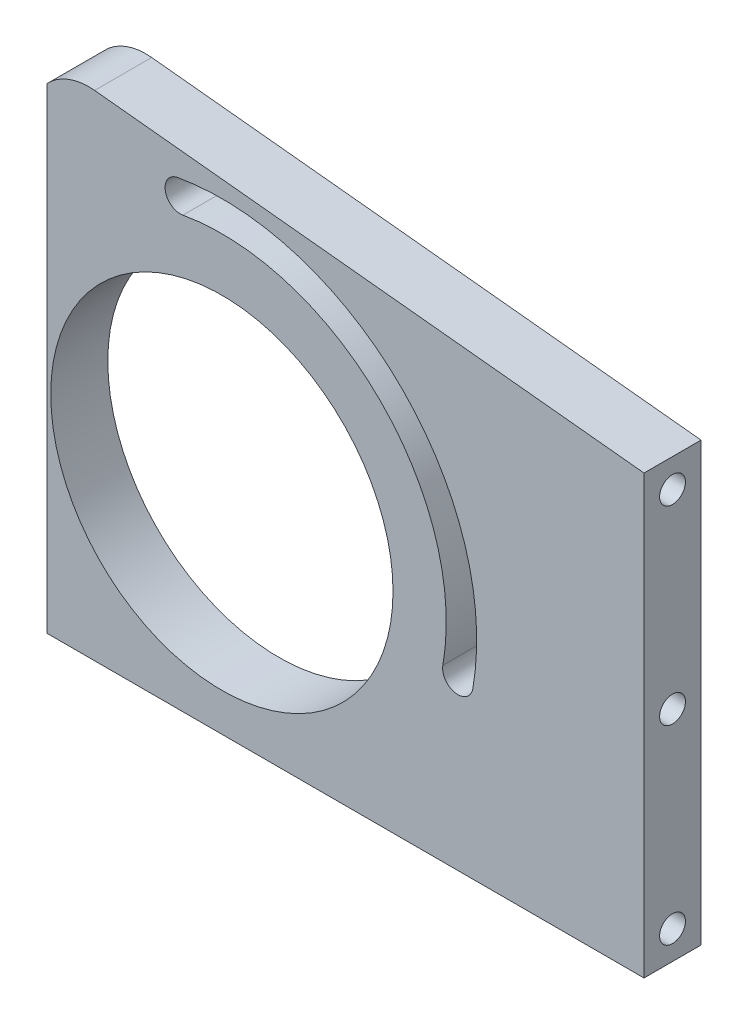
ISO-10303-21;
HEADER;
FILE_DESCRIPTION(('STEP AP214'),'2;1');
FILE_NAME('part.step','',(''),(''),'','','');
FILE_SCHEMA(('AUTOMOTIVE_DESIGN { 1 0 10303 214 1 1 1 1 }'));
ENDSEC;
DATA;
#1=APPLICATION_CONTEXT('core data for automotive mechanical design processes');
#2=APPLICATION_PROTOCOL_DEFINITION('international standard','automotive_design',2000,#1);
#3=PRODUCT_CONTEXT('',#1,'mechanical');
#4=PRODUCT('Part','Part','',(#3));
#5=PRODUCT_RELATED_PRODUCT_CATEGORY('part','',(#4));
#6=PRODUCT_DEFINITION_FORMATION('','',#4);
#7=PRODUCT_DEFINITION_CONTEXT('part definition',#1,'design');
#8=PRODUCT_DEFINITION('design','',#6,#7);
#9=PRODUCT_DEFINITION_SHAPE('','',#8);
#10=(LENGTH_UNIT() NAMED_UNIT(*) SI_UNIT(.MILLI.,.METRE.));
#11=(NAMED_UNIT(*) PLANE_ANGLE_UNIT() SI_UNIT($,.RADIAN.));
#12=(NAMED_UNIT(*) SI_UNIT($,.STERADIAN.) SOLID_ANGLE_UNIT());
#13=UNCERTAINTY_MEASURE_WITH_UNIT(LENGTH_MEASURE(1.E-05),#10,'distance_accuracy_value','');
#14=(GEOMETRIC_REPRESENTATION_CONTEXT(3) GLOBAL_UNCERTAINTY_ASSIGNED_CONTEXT((#13)) GLOBAL_UNIT_ASSIGNED_CONTEXT((#10,
#11,#12)) REPRESENTATION_CONTEXT('',''));
#15=CARTESIAN_POINT('',(0.,0.,0.));
#16=DIRECTION('',(0.,0.,1.));
#17=DIRECTION('',(1.,0.,0.));
#18=AXIS2_PLACEMENT_3D('',#15,#16,#17);
#19=CARTESIAN_POINT('',(-35.,59.9738962094959,7.5));
#20=DIRECTION('',(0.,0.,-1.));
#21=DIRECTION('',(-1.,0.,0.));
#22=AXIS2_PLACEMENT_3D('',#19,#20,#21);
#23=PLANE('',#22);
#24=CARTESIAN_POINT('',(0.,0.,7.5));
#25=DIRECTION('',(0.,0.,1.));
#26=DIRECTION('',(1.,0.,0.));
#27=AXIS2_PLACEMENT_3D('',#24,#25,#26);
#28=CIRCLE('',#27,45.);
#29=CARTESIAN_POINT('',(45.,0.,7.5));
#30=VERTEX_POINT('',#29);
#31=EDGE_CURVE('E157',#30,#30,#28,.T.);
#32=ORIENTED_EDGE('',*,*,#31,.F.);
#33=EDGE_LOOP('',(#32));
#34=FACE_BOUND('',#33,.T.);
#35=CARTESIAN_POINT('',(-35.,59.9738962094959,7.5));
#36=DIRECTION('',(0.,0.,1.));
#37=DIRECTION('',(-1.,0.,0.));
#38=AXIS2_PLACEMENT_3D('',#35,#36,#37);
#39=CIRCLE('',#38,15.);
#40=CARTESIAN_POINT('',(-33.461571863233,74.8947956082588,7.5));
#41=VERTEX_POINT('',#40);
#42=CARTESIAN_POINT('',(-46.,70.1719352366814,7.5));
#43=VERTEX_POINT('',#42);
#44=EDGE_CURVE('E165',#41,#43,#39,.T.);
#45=ORIENTED_EDGE('',*,*,#44,.T.);
#46=DIRECTION('',(0.,-1.,0.));
#47=VECTOR('',#46,1.);
#48=CARTESIAN_POINT('',(-46.,112.9,7.5));
#49=LINE('',#48,#47);
#50=CARTESIAN_POINT('',(-46.,-55.,7.5));
#51=VERTEX_POINT('',#50);
#52=EDGE_CURVE('E192',#43,#51,#49,.T.);
#53=ORIENTED_EDGE('',*,*,#52,.T.);
#54=DIRECTION('',(1.,0.,0.));
#55=VECTOR('',#54,1.);
#56=CARTESIAN_POINT('',(111.,-55.,7.5));
#57=LINE('',#56,#55);
#58=CARTESIAN_POINT('',(111.,-55.,7.5));
#59=VERTEX_POINT('',#58);
#60=EDGE_CURVE('E171',#51,#59,#57,.T.);
#61=ORIENTED_EDGE('',*,*,#60,.T.);
#62=DIRECTION('',(0.,1.,0.));
#63=VECTOR('',#62,1.);
#64=CARTESIAN_POINT('',(111.,60.,7.5));
#65=LINE('',#64,#63);
#66=CARTESIAN_POINT('',(111.,60.,7.5));
#67=VERTEX_POINT('',#66);
#68=EDGE_CURVE('E268',#59,#67,#65,.T.);
#69=ORIENTED_EDGE('',*,*,#68,.T.);
#70=DIRECTION('',(-0.994726626584196,0.102561875784457,0.));
#71=VECTOR('',#70,1.);
#72=CARTESIAN_POINT('',(-33.461571863233,74.8947956082588,7.5));
#73=LINE('',#72,#71);
#74=EDGE_CURVE('E269',#67,#41,#73,.T.);
#75=ORIENTED_EDGE('',*,*,#74,.T.);
#76=EDGE_LOOP('',(#45,#53,#61,#69,#75));
#77=FACE_BOUND('',#76,.T.);
#78=CARTESIAN_POINT('',(62.0428884397691,-10.9398351930167,7.5));
#79=DIRECTION('',(0.,0.,1.));
#80=DIRECTION('',(1.,0.,0.));
#81=AXIS2_PLACEMENT_3D('',#78,#79,#80);
#82=CIRCLE('',#81,4.);
#83=CARTESIAN_POINT('',(58.1036574277203,-10.2452424823489,7.5));
#84=VERTEX_POINT('',#83);
#85=CARTESIAN_POINT('',(65.9821194518179,-11.6344279036844,7.5));
#86=VERTEX_POINT('',#85);
#87=EDGE_CURVE('E235',#84,#86,#82,.T.);
#88=ORIENTED_EDGE('',*,*,#87,.F.);
#89=CARTESIAN_POINT('',(0.,0.,7.5));
#90=DIRECTION('',(0.,0.,-1.));
#91=DIRECTION('',(1.,0.,0.));
#92=AXIS2_PLACEMENT_3D('',#89,#90,#91);
#93=CIRCLE('',#92,59.);
#94=CARTESIAN_POINT('',(-10.245242482349,58.1036574277203,7.5));
#95=VERTEX_POINT('',#94);
#96=EDGE_CURVE('E243',#95,#84,#93,.T.);
#97=ORIENTED_EDGE('',*,*,#96,.F.);
#98=CARTESIAN_POINT('',(-10.9398351930167,62.0428884397691,7.5));
#99=DIRECTION('',(0.,0.,1.));
#100=DIRECTION('',(1.,0.,0.));
#101=AXIS2_PLACEMENT_3D('',#98,#99,#100);
#102=CIRCLE('',#101,4.);
#103=CARTESIAN_POINT('',(-11.6344279036844,65.9821194518179,7.5));
#104=VERTEX_POINT('',#103);
#105=EDGE_CURVE('E240',#104,#95,#102,.T.);
#106=ORIENTED_EDGE('',*,*,#105,.F.);
#107=CARTESIAN_POINT('',(0.,0.,7.5));
#108=DIRECTION('',(0.,0.,1.));
#109=DIRECTION('',(1.,0.,0.));
#110=AXIS2_PLACEMENT_3D('',#107,#108,#109);
#111=CIRCLE('',#110,67.);
#112=EDGE_CURVE('E237',#86,#104,#111,.T.);
#113=ORIENTED_EDGE('',*,*,#112,.F.);
#114=EDGE_LOOP('',(#88,#97,#106,#113));
#115=FACE_BOUND('',#114,.T.);
#116=ADVANCED_FACE('F36',(#34,#77,#115),#23,.F.);
#117=CARTESIAN_POINT('',(-35.,59.9738962094959,-7.5));
#118=DIRECTION('',(0.,0.,-1.));
#119=DIRECTION('',(-1.,0.,0.));
#120=AXIS2_PLACEMENT_3D('',#117,#118,#119);
#121=PLANE('',#120);
#122=DIRECTION('',(0.,-1.,0.));
#123=VECTOR('',#122,1.);
#124=CARTESIAN_POINT('',(-46.,112.9,-7.5));
#125=LINE('',#124,#123);
#126=CARTESIAN_POINT('',(-46.,70.1719352366814,-7.5));
#127=VERTEX_POINT('',#126);
#128=CARTESIAN_POINT('',(-46.,-55.,-7.5));
#129=VERTEX_POINT('',#128);
#130=EDGE_CURVE('E134',#127,#129,#125,.T.);
#131=ORIENTED_EDGE('',*,*,#130,.F.);
#132=CARTESIAN_POINT('',(-35.,59.9738962094959,-7.5));
#133=DIRECTION('',(0.,0.,1.));
#134=DIRECTION('',(-1.,0.,0.));
#135=AXIS2_PLACEMENT_3D('',#132,#133,#134);
#136=CIRCLE('',#135,15.);
#137=CARTESIAN_POINT('',(-33.461571863233,74.8947956082588,-7.5));
#138=VERTEX_POINT('',#137);
#139=EDGE_CURVE('E169',#138,#127,#136,.T.);
#140=ORIENTED_EDGE('',*,*,#139,.F.);
#141=DIRECTION('',(-0.994726626584196,0.102561875784457,0.));
#142=VECTOR('',#141,1.);
#143=CARTESIAN_POINT('',(-33.461571863233,74.8947956082588,-7.5));
#144=LINE('',#143,#142);
#145=CARTESIAN_POINT('',(111.,60.,-7.5));
#146=VERTEX_POINT('',#145);
#147=EDGE_CURVE('E159',#146,#138,#144,.T.);
#148=ORIENTED_EDGE('',*,*,#147,.F.);
#149=DIRECTION('',(0.,1.,0.));
#150=VECTOR('',#149,1.);
#151=CARTESIAN_POINT('',(111.,60.,-7.5));
#152=LINE('',#151,#150);
#153=CARTESIAN_POINT('',(111.,-55.,-7.5));
#154=VERTEX_POINT('',#153);
#155=EDGE_CURVE('E155',#154,#146,#152,.T.);
#156=ORIENTED_EDGE('',*,*,#155,.F.);
#157=DIRECTION('',(1.,0.,0.));
#158=VECTOR('',#157,1.);
#159=CARTESIAN_POINT('',(111.,-55.,-7.5));
#160=LINE('',#159,#158);
#161=EDGE_CURVE('E146',#129,#154,#160,.T.);
#162=ORIENTED_EDGE('',*,*,#161,.F.);
#163=EDGE_LOOP('',(#131,#140,#148,#156,#162));
#164=FACE_BOUND('',#163,.T.);
#165=CARTESIAN_POINT('',(0.,0.,-7.5));
#166=DIRECTION('',(0.,0.,1.));
#167=DIRECTION('',(1.,0.,0.));
#168=AXIS2_PLACEMENT_3D('',#165,#166,#167);
#169=CIRCLE('',#168,45.);
#170=CARTESIAN_POINT('',(45.,0.,-7.5));
#171=VERTEX_POINT('',#170);
#172=EDGE_CURVE('E162',#171,#171,#169,.T.);
#173=ORIENTED_EDGE('',*,*,#172,.T.);
#174=EDGE_LOOP('',(#173));
#175=FACE_BOUND('',#174,.T.);
#176=CARTESIAN_POINT('',(0.,0.,-7.5));
#177=DIRECTION('',(0.,0.,-1.));
#178=DIRECTION('',(1.,0.,0.));
#179=AXIS2_PLACEMENT_3D('',#176,#177,#178);
#180=CIRCLE('',#179,59.);
#181=CARTESIAN_POINT('',(-10.245242482349,58.1036574277203,-7.5));
#182=VERTEX_POINT('',#181);
#183=CARTESIAN_POINT('',(58.1036574277203,-10.2452424823489,-7.5));
#184=VERTEX_POINT('',#183);
#185=EDGE_CURVE('E238',#182,#184,#180,.T.);
#186=ORIENTED_EDGE('',*,*,#185,.T.);
#187=CARTESIAN_POINT('',(62.0428884397691,-10.9398351930167,-7.5));
#188=DIRECTION('',(0.,0.,1.));
#189=DIRECTION('',(1.,0.,0.));
#190=AXIS2_PLACEMENT_3D('',#187,#188,#189);
#191=CIRCLE('',#190,4.);
#192=CARTESIAN_POINT('',(65.9821194518179,-11.6344279036844,-7.5));
#193=VERTEX_POINT('',#192);
#194=EDGE_CURVE('E234',#184,#193,#191,.T.);
#195=ORIENTED_EDGE('',*,*,#194,.T.);
#196=CARTESIAN_POINT('',(0.,0.,-7.5));
#197=DIRECTION('',(0.,0.,1.));
#198=DIRECTION('',(1.,0.,0.));
#199=AXIS2_PLACEMENT_3D('',#196,#197,#198);
#200=CIRCLE('',#199,67.);
#201=CARTESIAN_POINT('',(-11.6344279036844,65.9821194518179,-7.5));
#202=VERTEX_POINT('',#201);
#203=EDGE_CURVE('E248',#193,#202,#200,.T.);
#204=ORIENTED_EDGE('',*,*,#203,.T.);
#205=CARTESIAN_POINT('',(-10.9398351930167,62.0428884397691,-7.5));
#206=DIRECTION('',(0.,0.,1.));
#207=DIRECTION('',(1.,0.,0.));
#208=AXIS2_PLACEMENT_3D('',#205,#206,#207);
#209=CIRCLE('',#208,4.);
#210=EDGE_CURVE('E251',#202,#182,#209,.T.);
#211=ORIENTED_EDGE('',*,*,#210,.T.);
#212=EDGE_LOOP('',(#186,#195,#204,#211));
#213=FACE_BOUND('',#212,.T.);
#214=ADVANCED_FACE('F152',(#164,#175,#213),#121,.T.);
#215=CARTESIAN_POINT('',(111.,-55.,7.5));
#216=DIRECTION('',(0.,1.,0.));
#217=DIRECTION('',(-1.,0.,0.));
#218=AXIS2_PLACEMENT_3D('',#215,#216,#217);
#219=PLANE('',#218);
#220=CARTESIAN_POINT('',(-42.5,-55.,0.));
#221=DIRECTION('',(0.,-1.,0.));
#222=DIRECTION('',(0.,0.,-1.));
#223=AXIS2_PLACEMENT_3D('',#220,#221,#222);
#224=CIRCLE('',#223,3.39999999999999);
#225=CARTESIAN_POINT('',(-42.5,-55.,-3.39999999999999));
#226=VERTEX_POINT('',#225);
#227=EDGE_CURVE('E198',#226,#226,#224,.T.);
#228=ORIENTED_EDGE('',*,*,#227,.F.);
#229=EDGE_LOOP('',(#228));
#230=FACE_BOUND('',#229,.T.);
#231=CARTESIAN_POINT('',(16.3,-55.,0.));
#232=DIRECTION('',(0.,-1.,0.));
#233=DIRECTION('',(0.,0.,-1.));
#234=AXIS2_PLACEMENT_3D('',#231,#232,#233);
#235=CIRCLE('',#234,3.39999999999999);
#236=CARTESIAN_POINT('',(16.3,-55.,-3.39999999999999));
#237=VERTEX_POINT('',#236);
#238=EDGE_CURVE('E204',#237,#237,#235,.T.);
#239=ORIENTED_EDGE('',*,*,#238,.F.);
#240=EDGE_LOOP('',(#239));
#241=FACE_BOUND('',#240,.T.);
#242=CARTESIAN_POINT('',(75.1,-55.,0.));
#243=DIRECTION('',(0.,-1.,0.));
#244=DIRECTION('',(0.,0.,-1.));
#245=AXIS2_PLACEMENT_3D('',#242,#243,#244);
#246=CIRCLE('',#245,3.39999999999999);
#247=CARTESIAN_POINT('',(75.1,-55.,-3.39999999999999));
#248=VERTEX_POINT('',#247);
#249=EDGE_CURVE('E210',#248,#248,#246,.T.);
#250=ORIENTED_EDGE('',*,*,#249,.F.);
#251=EDGE_LOOP('',(#250));
#252=FACE_BOUND('',#251,.T.);
#253=DIRECTION('',(0.,0.,-1.));
#254=VECTOR('',#253,1.);
#255=CARTESIAN_POINT('',(-50.,-55.,7.5));
#256=LINE('',#255,#254);
#257=CARTESIAN_POINT('',(-50.,-55.,3.5));
#258=VERTEX_POINT('',#257);
#259=CARTESIAN_POINT('',(-50.,-55.,-3.5));
#260=VERTEX_POINT('',#259);
#261=EDGE_CURVE('E150',#258,#260,#256,.T.);
#262=ORIENTED_EDGE('',*,*,#261,.T.);
#263=DIRECTION('',(-0.707106781186548,0.,0.707106781186547));
#264=VECTOR('',#263,1.);
#265=CARTESIAN_POINT('',(-50.,-55.,-3.5));
#266=LINE('',#265,#264);
#267=EDGE_CURVE('E51',#129,#260,#266,.T.);
#268=ORIENTED_EDGE('',*,*,#267,.F.);
#269=ORIENTED_EDGE('',*,*,#161,.T.);
#270=DIRECTION('',(0.,0.,-1.));
#271=VECTOR('',#270,1.);
#272=CARTESIAN_POINT('',(111.,-55.,7.5));
#273=LINE('',#272,#271);
#274=EDGE_CURVE('E182',#59,#154,#273,.T.);
#275=ORIENTED_EDGE('',*,*,#274,.F.);
#276=ORIENTED_EDGE('',*,*,#60,.F.);
#277=DIRECTION('',(0.707106781186547,0.,0.707106781186548));
#278=VECTOR('',#277,1.);
#279=CARTESIAN_POINT('',(-50.,-55.,3.5));
#280=LINE('',#279,#278);
#281=EDGE_CURVE('E190',#258,#51,#280,.T.);
#282=ORIENTED_EDGE('',*,*,#281,.F.);
#283=EDGE_LOOP('',(#262,#268,#269,#275,#276,#282));
#284=FACE_BOUND('',#283,.T.);
#285=ADVANCED_FACE('F38',(#230,#241,#252,#284),#219,.F.);
#286=CARTESIAN_POINT('',(111.,60.,7.5));
#287=DIRECTION('',(-1.,0.,0.));
#288=DIRECTION('',(0.,0.,1.));
#289=AXIS2_PLACEMENT_3D('',#286,#287,#288);
#290=PLANE('',#289);
#291=CARTESIAN_POINT('',(111.,52.5,0.));
#292=DIRECTION('',(1.,0.,0.));
#293=DIRECTION('',(0.,0.,-1.));
#294=AXIS2_PLACEMENT_3D('',#291,#292,#293);
#295=CIRCLE('',#294,3.4);
#296=CARTESIAN_POINT('',(111.,52.5,-3.4));
#297=VERTEX_POINT('',#296);
#298=EDGE_CURVE('E216',#297,#297,#295,.T.);
#299=ORIENTED_EDGE('',*,*,#298,.F.);
#300=EDGE_LOOP('',(#299));
#301=FACE_BOUND('',#300,.T.);
#302=CARTESIAN_POINT('',(111.,2.50000000000002,0.));
#303=DIRECTION('',(1.,0.,0.));
#304=DIRECTION('',(0.,0.,-1.));
#305=AXIS2_PLACEMENT_3D('',#302,#303,#304);
#306=CIRCLE('',#305,3.4);
#307=CARTESIAN_POINT('',(111.,2.50000000000002,-3.4));
#308=VERTEX_POINT('',#307);
#309=EDGE_CURVE('E222',#308,#308,#306,.T.);
#310=ORIENTED_EDGE('',*,*,#309,.F.);
#311=EDGE_LOOP('',(#310));
#312=FACE_BOUND('',#311,.T.);
#313=CARTESIAN_POINT('',(111.,-47.5,0.));
#314=DIRECTION('',(1.,0.,0.));
#315=DIRECTION('',(0.,0.,-1.));
#316=AXIS2_PLACEMENT_3D('',#313,#314,#315);
#317=CIRCLE('',#316,3.4);
#318=CARTESIAN_POINT('',(111.,-47.5,-3.4));
#319=VERTEX_POINT('',#318);
#320=EDGE_CURVE('E228',#319,#319,#317,.T.);
#321=ORIENTED_EDGE('',*,*,#320,.F.);
#322=EDGE_LOOP('',(#321));
#323=FACE_BOUND('',#322,.T.);
#324=ORIENTED_EDGE('',*,*,#155,.T.);
#325=DIRECTION('',(0.,0.,-1.));
#326=VECTOR('',#325,1.);
#327=CARTESIAN_POINT('',(111.,60.,7.5));
#328=LINE('',#327,#326);
#329=EDGE_CURVE('E179',#67,#146,#328,.T.);
#330=ORIENTED_EDGE('',*,*,#329,.F.);
#331=ORIENTED_EDGE('',*,*,#68,.F.);
#332=ORIENTED_EDGE('',*,*,#274,.T.);
#333=EDGE_LOOP('',(#324,#330,#331,#332));
#334=FACE_BOUND('',#333,.T.);
#335=ADVANCED_FACE('F280',(#301,#312,#323,#334),#290,.F.);
#336=CARTESIAN_POINT('',(-33.461571863233,74.8947956082588,7.5));
#337=DIRECTION('',(-0.102561875784457,-0.994726626584196,0.));
#338=DIRECTION('',(0.994726626584196,-0.102561875784457,0.));
#339=AXIS2_PLACEMENT_3D('',#336,#337,#338);
#340=PLANE('',#339);
#341=ORIENTED_EDGE('',*,*,#147,.T.);
#342=DIRECTION('',(0.,0.,-1.));
#343=VECTOR('',#342,1.);
#344=CARTESIAN_POINT('',(-33.461571863233,74.8947956082588,7.5));
#345=LINE('',#344,#343);
#346=EDGE_CURVE('E176',#41,#138,#345,.T.);
#347=ORIENTED_EDGE('',*,*,#346,.F.);
#348=ORIENTED_EDGE('',*,*,#74,.F.);
#349=ORIENTED_EDGE('',*,*,#329,.T.);
#350=EDGE_LOOP('',(#341,#347,#348,#349));
#351=FACE_BOUND('',#350,.T.);
#352=ADVANCED_FACE('F276',(#351),#340,.F.);
#353=CARTESIAN_POINT('',(-35.,59.9738962094959,7.5));
#354=DIRECTION('',(0.,0.,-1.));
#355=DIRECTION('',(-1.,0.,0.));
#356=AXIS2_PLACEMENT_3D('',#353,#354,#355);
#357=CYLINDRICAL_SURFACE('',#356,15.);
#358=ORIENTED_EDGE('',*,*,#139,.T.);
#359=CARTESIAN_POINT('',(-35.,59.9738962094959,-18.5));
#360=DIRECTION('',(0.707106781186547,0.,0.707106781186548));
#361=DIRECTION('',(0.707106781186548,0.,-0.707106781186547));
#362=AXIS2_PLACEMENT_3D('',#359,#360,#361);
#363=ELLIPSE('',#362,21.2132034355964,15.);
#364=CARTESIAN_POINT('',(-50.,59.9738962094958,-3.5));
#365=VERTEX_POINT('',#364);
#366=EDGE_CURVE('E137',#127,#365,#363,.T.);
#367=ORIENTED_EDGE('',*,*,#366,.T.);
#368=DIRECTION('',(0.,0.,-1.));
#369=VECTOR('',#368,1.);
#370=CARTESIAN_POINT('',(-50.,59.9738962094958,7.5));
#371=LINE('',#370,#369);
#372=CARTESIAN_POINT('',(-50.,59.9738962094958,3.50000000000001));
#373=VERTEX_POINT('',#372);
#374=EDGE_CURVE('E173',#373,#365,#371,.T.);
#375=ORIENTED_EDGE('',*,*,#374,.F.);
#376=CARTESIAN_POINT('',(-35.,59.9738962094959,18.5));
#377=DIRECTION('',(0.707106781186548,0.,-0.707106781186547));
#378=DIRECTION('',(-0.707106781186547,0.,-0.707106781186548));
#379=AXIS2_PLACEMENT_3D('',#376,#377,#378);
#380=ELLIPSE('',#379,21.2132034355964,15.);
#381=EDGE_CURVE('E58',#373,#43,#380,.T.);
#382=ORIENTED_EDGE('',*,*,#381,.T.);
#383=ORIENTED_EDGE('',*,*,#44,.F.);
#384=ORIENTED_EDGE('',*,*,#346,.T.);
#385=EDGE_LOOP('',(#358,#367,#375,#382,#383,#384));
#386=FACE_BOUND('',#385,.T.);
#387=ADVANCED_FACE('F187',(#386),#357,.T.);
#388=CARTESIAN_POINT('',(-50.,-55.,7.5));
#389=DIRECTION('',(1.,0.,0.));
#390=DIRECTION('',(0.,0.,-1.));
#391=AXIS2_PLACEMENT_3D('',#388,#389,#390);
#392=PLANE('',#391);
#393=ORIENTED_EDGE('',*,*,#374,.T.);
#394=DIRECTION('',(0.,-1.,0.));
#395=VECTOR('',#394,1.);
#396=CARTESIAN_POINT('',(-50.,-55.,-3.5));
#397=LINE('',#396,#395);
#398=EDGE_CURVE('E11',#365,#260,#397,.T.);
#399=ORIENTED_EDGE('',*,*,#398,.T.);
#400=ORIENTED_EDGE('',*,*,#261,.F.);
#401=DIRECTION('',(0.,1.,0.));
#402=VECTOR('',#401,1.);
#403=CARTESIAN_POINT('',(-50.,-55.,3.5));
#404=LINE('',#403,#402);
#405=EDGE_CURVE('E44',#258,#373,#404,.T.);
#406=ORIENTED_EDGE('',*,*,#405,.T.);
#407=EDGE_LOOP('',(#393,#399,#400,#406));
#408=FACE_BOUND('',#407,.T.);
#409=ADVANCED_FACE('F185',(#408),#392,.F.);
#410=CARTESIAN_POINT('',(0.,0.,7.5));
#411=DIRECTION('',(0.,0.,-1.));
#412=DIRECTION('',(-1.,0.,0.));
#413=AXIS2_PLACEMENT_3D('',#410,#411,#412);
#414=CYLINDRICAL_SURFACE('',#413,45.);
#415=ORIENTED_EDGE('',*,*,#31,.T.);
#416=EDGE_LOOP('',(#415));
#417=FACE_BOUND('',#416,.T.);
#418=ORIENTED_EDGE('',*,*,#172,.F.);
#419=EDGE_LOOP('',(#418));
#420=FACE_BOUND('',#419,.T.);
#421=ADVANCED_FACE('F302',(#417,#420),#414,.F.);
#422=CARTESIAN_POINT('',(62.0428884397691,-10.9398351930167,7.5));
#423=DIRECTION('',(0.,0.,-1.));
#424=DIRECTION('',(-1.,0.,0.));
#425=AXIS2_PLACEMENT_3D('',#422,#423,#424);
#426=CYLINDRICAL_SURFACE('',#425,4.);
#427=ORIENTED_EDGE('',*,*,#194,.F.);
#428=DIRECTION('',(0.,0.,-1.));
#429=VECTOR('',#428,1.);
#430=CARTESIAN_POINT('',(58.1036574277203,-10.2452424823489,7.5));
#431=LINE('',#430,#429);
#432=EDGE_CURVE('E245',#84,#184,#431,.T.);
#433=ORIENTED_EDGE('',*,*,#432,.F.);
#434=ORIENTED_EDGE('',*,*,#87,.T.);
#435=DIRECTION('',(0.,0.,-1.));
#436=VECTOR('',#435,1.);
#437=CARTESIAN_POINT('',(65.9821194518179,-11.6344279036844,7.5));
#438=LINE('',#437,#436);
#439=EDGE_CURVE('E262',#86,#193,#438,.T.);
#440=ORIENTED_EDGE('',*,*,#439,.T.);
#441=EDGE_LOOP('',(#427,#433,#434,#440));
#442=FACE_BOUND('',#441,.T.);
#443=ADVANCED_FACE('F350',(#442),#426,.F.);
#444=CARTESIAN_POINT('',(0.,0.,7.5));
#445=DIRECTION('',(0.,0.,-1.));
#446=DIRECTION('',(-1.,0.,0.));
#447=AXIS2_PLACEMENT_3D('',#444,#445,#446);
#448=CYLINDRICAL_SURFACE('',#447,67.);
#449=ORIENTED_EDGE('',*,*,#203,.F.);
#450=ORIENTED_EDGE('',*,*,#439,.F.);
#451=ORIENTED_EDGE('',*,*,#112,.T.);
#452=DIRECTION('',(0.,0.,-1.));
#453=VECTOR('',#452,1.);
#454=CARTESIAN_POINT('',(-11.6344279036844,65.9821194518179,7.5));
#455=LINE('',#454,#453);
#456=EDGE_CURVE('E260',#104,#202,#455,.T.);
#457=ORIENTED_EDGE('',*,*,#456,.T.);
#458=EDGE_LOOP('',(#449,#450,#451,#457));
#459=FACE_BOUND('',#458,.T.);
#460=ADVANCED_FACE('F347',(#459),#448,.F.);
#461=CARTESIAN_POINT('',(-10.9398351930167,62.0428884397691,7.5));
#462=DIRECTION('',(0.,0.,-1.));
#463=DIRECTION('',(-1.,0.,0.));
#464=AXIS2_PLACEMENT_3D('',#461,#462,#463);
#465=CYLINDRICAL_SURFACE('',#464,4.);
#466=ORIENTED_EDGE('',*,*,#210,.F.);
#467=ORIENTED_EDGE('',*,*,#456,.F.);
#468=ORIENTED_EDGE('',*,*,#105,.T.);
#469=DIRECTION('',(0.,0.,-1.));
#470=VECTOR('',#469,1.);
#471=CARTESIAN_POINT('',(-10.245242482349,58.1036574277203,7.5));
#472=LINE('',#471,#470);
#473=EDGE_CURVE('E258',#95,#182,#472,.T.);
#474=ORIENTED_EDGE('',*,*,#473,.T.);
#475=EDGE_LOOP('',(#466,#467,#468,#474));
#476=FACE_BOUND('',#475,.T.);
#477=ADVANCED_FACE('F343',(#476),#465,.F.);
#478=CARTESIAN_POINT('',(0.,0.,7.5));
#479=DIRECTION('',(0.,0.,-1.));
#480=DIRECTION('',(-1.,0.,0.));
#481=AXIS2_PLACEMENT_3D('',#478,#479,#480);
#482=CYLINDRICAL_SURFACE('',#481,59.);
#483=ORIENTED_EDGE('',*,*,#185,.F.);
#484=ORIENTED_EDGE('',*,*,#473,.F.);
#485=ORIENTED_EDGE('',*,*,#96,.T.);
#486=ORIENTED_EDGE('',*,*,#432,.T.);
#487=EDGE_LOOP('',(#483,#484,#485,#486));
#488=FACE_BOUND('',#487,.T.);
#489=ADVANCED_FACE('F335',(#488),#482,.T.);
#490=CARTESIAN_POINT('',(91.,-47.5,0.));
#491=DIRECTION('',(1.,0.,0.));
#492=DIRECTION('',(0.,0.,-1.));
#493=AXIS2_PLACEMENT_3D('',#490,#491,#492);
#494=CONICAL_SURFACE('',#493,3.39999999999999,1.02974425867665);
#495=CARTESIAN_POINT('',(88.9570738953063,-47.5,0.));
#496=VERTEX_POINT('',#495);
#497=VERTEX_LOOP('',#496);
#498=FACE_BOUND('',#497,.T.);
#499=CARTESIAN_POINT('',(91.,-47.5,0.));
#500=DIRECTION('',(1.,0.,0.));
#501=DIRECTION('',(0.,0.,-1.));
#502=AXIS2_PLACEMENT_3D('',#499,#500,#501);
#503=CIRCLE('',#502,3.39999999999999);
#504=CARTESIAN_POINT('',(91.,-47.5,-3.39999999999999));
#505=VERTEX_POINT('',#504);
#506=EDGE_CURVE('E231',#505,#505,#503,.T.);
#507=ORIENTED_EDGE('',*,*,#506,.T.);
#508=EDGE_LOOP('',(#507));
#509=FACE_BOUND('',#508,.T.);
#510=ADVANCED_FACE('F325',(#498,#509),#494,.F.);
#511=CARTESIAN_POINT('',(111.,-47.5,0.));
#512=DIRECTION('',(1.,0.,0.));
#513=DIRECTION('',(0.,0.,-1.));
#514=AXIS2_PLACEMENT_3D('',#511,#512,#513);
#515=CYLINDRICAL_SURFACE('',#514,3.4);
#516=ORIENTED_EDGE('',*,*,#506,.F.);
#517=EDGE_LOOP('',(#516));
#518=FACE_BOUND('',#517,.T.);
#519=ORIENTED_EDGE('',*,*,#320,.T.);
#520=EDGE_LOOP('',(#519));
#521=FACE_BOUND('',#520,.T.);
#522=ADVANCED_FACE('F322',(#518,#521),#515,.F.);
#523=CARTESIAN_POINT('',(91.,2.50000000000002,0.));
#524=DIRECTION('',(1.,0.,0.));
#525=DIRECTION('',(0.,0.,-1.));
#526=AXIS2_PLACEMENT_3D('',#523,#524,#525);
#527=CONICAL_SURFACE('',#526,3.4,1.02974425867665);
#528=CARTESIAN_POINT('',(88.9570738953063,2.50000000000001,0.));
#529=VERTEX_POINT('',#528);
#530=VERTEX_LOOP('',#529);
#531=FACE_BOUND('',#530,.T.);
#532=CARTESIAN_POINT('',(91.,2.50000000000002,0.));
#533=DIRECTION('',(1.,0.,0.));
#534=DIRECTION('',(0.,0.,-1.));
#535=AXIS2_PLACEMENT_3D('',#532,#533,#534);
#536=CIRCLE('',#535,3.4);
#537=CARTESIAN_POINT('',(91.,2.50000000000002,-3.4));
#538=VERTEX_POINT('',#537);
#539=EDGE_CURVE('E225',#538,#538,#536,.T.);
#540=ORIENTED_EDGE('',*,*,#539,.T.);
#541=EDGE_LOOP('',(#540));
#542=FACE_BOUND('',#541,.T.);
#543=ADVANCED_FACE('F324',(#531,#542),#527,.F.);
#544=CARTESIAN_POINT('',(111.,2.50000000000002,0.));
#545=DIRECTION('',(1.,0.,0.));
#546=DIRECTION('',(0.,0.,-1.));
#547=AXIS2_PLACEMENT_3D('',#544,#545,#546);
#548=CYLINDRICAL_SURFACE('',#547,3.4);
#549=ORIENTED_EDGE('',*,*,#539,.F.);
#550=EDGE_LOOP('',(#549));
#551=FACE_BOUND('',#550,.T.);
#552=ORIENTED_EDGE('',*,*,#309,.T.);
#553=EDGE_LOOP('',(#552));
#554=FACE_BOUND('',#553,.T.);
#555=ADVANCED_FACE('F332',(#551,#554),#548,.F.);
#556=CARTESIAN_POINT('',(91.,52.5,0.));
#557=DIRECTION('',(1.,0.,0.));
#558=DIRECTION('',(0.,0.,-1.));
#559=AXIS2_PLACEMENT_3D('',#556,#557,#558);
#560=CONICAL_SURFACE('',#559,3.39999999999999,1.02974425867665);
#561=CARTESIAN_POINT('',(88.9570738953063,52.5,0.));
#562=VERTEX_POINT('',#561);
#563=VERTEX_LOOP('',#562);
#564=FACE_BOUND('',#563,.T.);
#565=CARTESIAN_POINT('',(91.,52.5,0.));
#566=DIRECTION('',(1.,0.,0.));
#567=DIRECTION('',(0.,0.,-1.));
#568=AXIS2_PLACEMENT_3D('',#565,#566,#567);
#569=CIRCLE('',#568,3.39999999999999);
#570=CARTESIAN_POINT('',(91.,52.5,-3.39999999999999));
#571=VERTEX_POINT('',#570);
#572=EDGE_CURVE('E219',#571,#571,#569,.T.);
#573=ORIENTED_EDGE('',*,*,#572,.T.);
#574=EDGE_LOOP('',(#573));
#575=FACE_BOUND('',#574,.T.);
#576=ADVANCED_FACE('F440',(#564,#575),#560,.F.);
#577=CARTESIAN_POINT('',(111.,52.5,0.));
#578=DIRECTION('',(1.,0.,0.));
#579=DIRECTION('',(0.,0.,-1.));
#580=AXIS2_PLACEMENT_3D('',#577,#578,#579);
#581=CYLINDRICAL_SURFACE('',#580,3.4);
#582=ORIENTED_EDGE('',*,*,#572,.F.);
#583=EDGE_LOOP('',(#582));
#584=FACE_BOUND('',#583,.T.);
#585=ORIENTED_EDGE('',*,*,#298,.T.);
#586=EDGE_LOOP('',(#585));
#587=FACE_BOUND('',#586,.T.);
#588=ADVANCED_FACE('F449',(#584,#587),#581,.F.);
#589=CARTESIAN_POINT('',(75.1,-45.,0.));
#590=DIRECTION('',(0.,-1.,0.));
#591=DIRECTION('',(0.,0.,-1.));
#592=AXIS2_PLACEMENT_3D('',#589,#590,#591);
#593=CONICAL_SURFACE('',#592,3.4,1.02974425867665);
#594=CARTESIAN_POINT('',(75.1,-42.9570738953063,0.));
#595=VERTEX_POINT('',#594);
#596=VERTEX_LOOP('',#595);
#597=FACE_BOUND('',#596,.T.);
#598=CARTESIAN_POINT('',(75.1,-45.,0.));
#599=DIRECTION('',(0.,-1.,0.));
#600=DIRECTION('',(0.,0.,-1.));
#601=AXIS2_PLACEMENT_3D('',#598,#599,#600);
#602=CIRCLE('',#601,3.4);
#603=CARTESIAN_POINT('',(75.1,-45.,-3.4));
#604=VERTEX_POINT('',#603);
#605=EDGE_CURVE('E213',#604,#604,#602,.T.);
#606=ORIENTED_EDGE('',*,*,#605,.T.);
#607=EDGE_LOOP('',(#606));
#608=FACE_BOUND('',#607,.T.);
#609=ADVANCED_FACE('F458',(#597,#608),#593,.F.);
#610=CARTESIAN_POINT('',(75.1,-55.,0.));
#611=DIRECTION('',(0.,-1.,0.));
#612=DIRECTION('',(0.,0.,-1.));
#613=AXIS2_PLACEMENT_3D('',#610,#611,#612);
#614=CYLINDRICAL_SURFACE('',#613,3.39999999999999);
#615=ORIENTED_EDGE('',*,*,#605,.F.);
#616=EDGE_LOOP('',(#615));
#617=FACE_BOUND('',#616,.T.);
#618=ORIENTED_EDGE('',*,*,#249,.T.);
#619=EDGE_LOOP('',(#618));
#620=FACE_BOUND('',#619,.T.);
#621=ADVANCED_FACE('F468',(#617,#620),#614,.F.);
#622=CARTESIAN_POINT('',(16.3,-45.,0.));
#623=DIRECTION('',(0.,-1.,0.));
#624=DIRECTION('',(0.,0.,-1.));
#625=AXIS2_PLACEMENT_3D('',#622,#623,#624);
#626=CONICAL_SURFACE('',#625,3.4,1.02974425867665);
#627=CARTESIAN_POINT('',(16.3,-42.9570738953063,0.));
#628=VERTEX_POINT('',#627);
#629=VERTEX_LOOP('',#628);
#630=FACE_BOUND('',#629,.T.);
#631=CARTESIAN_POINT('',(16.3,-45.,0.));
#632=DIRECTION('',(0.,-1.,0.));
#633=DIRECTION('',(0.,0.,-1.));
#634=AXIS2_PLACEMENT_3D('',#631,#632,#633);
#635=CIRCLE('',#634,3.4);
#636=CARTESIAN_POINT('',(16.3,-45.,-3.4));
#637=VERTEX_POINT('',#636);
#638=EDGE_CURVE('E207',#637,#637,#635,.T.);
#639=ORIENTED_EDGE('',*,*,#638,.T.);
#640=EDGE_LOOP('',(#639));
#641=FACE_BOUND('',#640,.T.);
#642=ADVANCED_FACE('F477',(#630,#641),#626,.F.);
#643=CARTESIAN_POINT('',(16.3,-55.,0.));
#644=DIRECTION('',(0.,-1.,0.));
#645=DIRECTION('',(0.,0.,-1.));
#646=AXIS2_PLACEMENT_3D('',#643,#644,#645);
#647=CYLINDRICAL_SURFACE('',#646,3.39999999999999);
#648=ORIENTED_EDGE('',*,*,#638,.F.);
#649=EDGE_LOOP('',(#648));
#650=FACE_BOUND('',#649,.T.);
#651=ORIENTED_EDGE('',*,*,#238,.T.);
#652=EDGE_LOOP('',(#651));
#653=FACE_BOUND('',#652,.T.);
#654=ADVANCED_FACE('F487',(#650,#653),#647,.F.);
#655=CARTESIAN_POINT('',(-42.5,-45.,0.));
#656=DIRECTION('',(0.,-1.,0.));
#657=DIRECTION('',(0.,0.,-1.));
#658=AXIS2_PLACEMENT_3D('',#655,#656,#657);
#659=CONICAL_SURFACE('',#658,3.39999999999999,1.02974425867665);
#660=CARTESIAN_POINT('',(-42.5,-42.9570738953063,0.));
#661=VERTEX_POINT('',#660);
#662=VERTEX_LOOP('',#661);
#663=FACE_BOUND('',#662,.T.);
#664=CARTESIAN_POINT('',(-42.5,-45.,0.));
#665=DIRECTION('',(0.,-1.,0.));
#666=DIRECTION('',(0.,0.,-1.));
#667=AXIS2_PLACEMENT_3D('',#664,#665,#666);
#668=CIRCLE('',#667,3.39999999999999);
#669=CARTESIAN_POINT('',(-42.5,-45.,-3.39999999999999));
#670=VERTEX_POINT('',#669);
#671=EDGE_CURVE('E201',#670,#670,#668,.T.);
#672=ORIENTED_EDGE('',*,*,#671,.T.);
#673=EDGE_LOOP('',(#672));
#674=FACE_BOUND('',#673,.T.);
#675=ADVANCED_FACE('F290',(#663,#674),#659,.F.);
#676=CARTESIAN_POINT('',(-42.5,-55.,0.));
#677=DIRECTION('',(0.,-1.,0.));
#678=DIRECTION('',(0.,0.,-1.));
#679=AXIS2_PLACEMENT_3D('',#676,#677,#678);
#680=CYLINDRICAL_SURFACE('',#679,3.39999999999999);
#681=ORIENTED_EDGE('',*,*,#671,.F.);
#682=EDGE_LOOP('',(#681));
#683=FACE_BOUND('',#682,.T.);
#684=ORIENTED_EDGE('',*,*,#227,.T.);
#685=EDGE_LOOP('',(#684));
#686=FACE_BOUND('',#685,.T.);
#687=ADVANCED_FACE('F283',(#683,#686),#680,.F.);
#688=CARTESIAN_POINT('',(-50.,112.9,3.5));
#689=DIRECTION('',(0.707106781186548,0.,-0.707106781186547));
#690=DIRECTION('',(-0.707106781186547,0.,-0.707106781186548));
#691=AXIS2_PLACEMENT_3D('',#688,#689,#690);
#692=PLANE('',#691);
#693=ORIENTED_EDGE('',*,*,#405,.F.);
#694=ORIENTED_EDGE('',*,*,#281,.T.);
#695=ORIENTED_EDGE('',*,*,#52,.F.);
#696=ORIENTED_EDGE('',*,*,#381,.F.);
#697=EDGE_LOOP('',(#693,#694,#695,#696));
#698=FACE_BOUND('',#697,.T.);
#699=ADVANCED_FACE('F281',(#698),#692,.F.);
#700=CARTESIAN_POINT('',(-50.,112.9,-3.5));
#701=DIRECTION('',(0.707106781186547,0.,0.707106781186548));
#702=DIRECTION('',(0.707106781186548,0.,-0.707106781186547));
#703=AXIS2_PLACEMENT_3D('',#700,#701,#702);
#704=PLANE('',#703);
#705=ORIENTED_EDGE('',*,*,#130,.T.);
#706=ORIENTED_EDGE('',*,*,#267,.T.);
#707=ORIENTED_EDGE('',*,*,#398,.F.);
#708=ORIENTED_EDGE('',*,*,#366,.F.);
#709=EDGE_LOOP('',(#705,#706,#707,#708));
#710=FACE_BOUND('',#709,.T.);
#711=ADVANCED_FACE('F135',(#710),#704,.F.);
#712=CLOSED_SHELL('',(#116,#214,#285,#335,#352,#387,#409,#421,#443,#460,#477,#489,#510,#522,
#543,#555,#576,#588,#609,#621,#642,#654,#675,#687,#699,#711));
#713=MANIFOLD_SOLID_BREP('B2',#712);
#714=ADVANCED_BREP_SHAPE_REPRESENTATION('',(#18,#713),#14);
#715=SHAPE_DEFINITION_REPRESENTATION(#9,#714);
ENDSEC;
END-ISO-10303-21;
